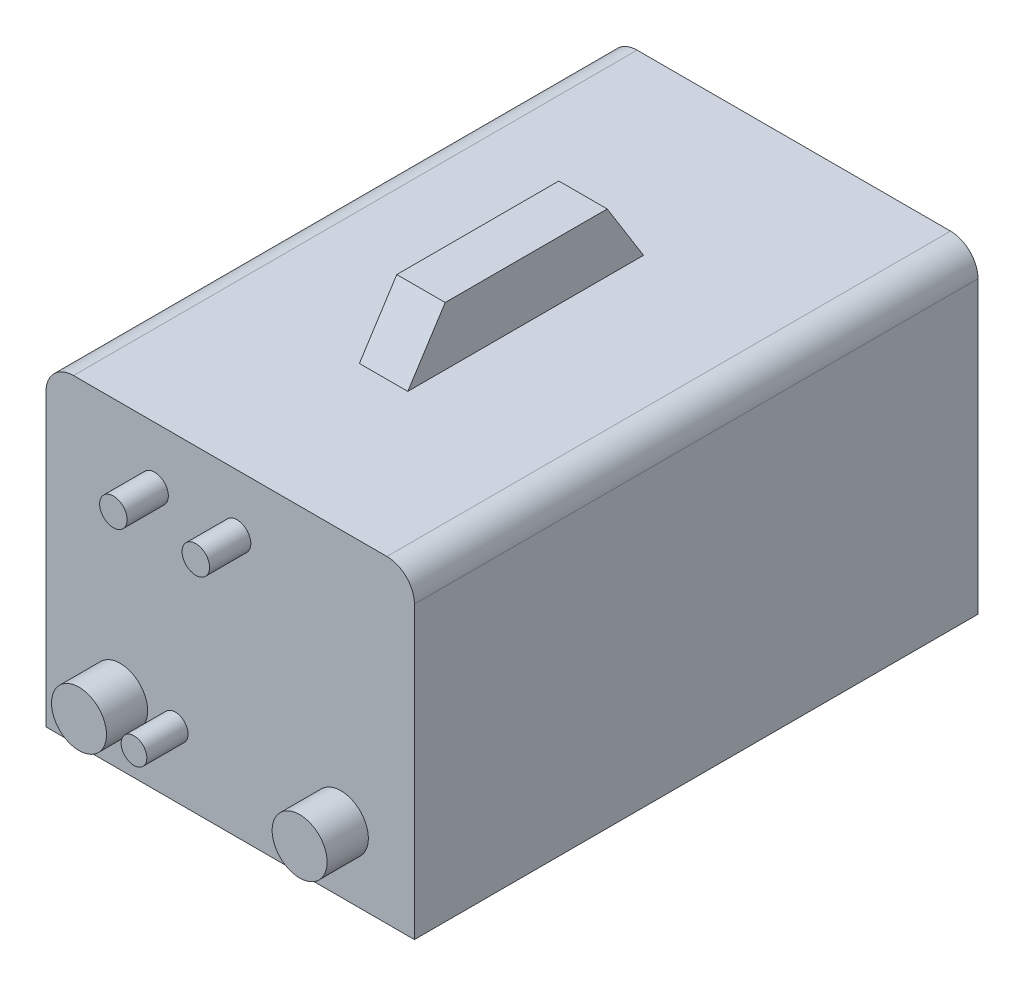
ISO-10303-21;
HEADER;
FILE_DESCRIPTION(('STEP AP214'),'2;1');
FILE_NAME('part.step','',(''),(''),'','','');
FILE_SCHEMA(('AUTOMOTIVE_DESIGN { 1 0 10303 214 1 1 1 1 }'));
ENDSEC;
DATA;
#1=APPLICATION_CONTEXT('core data for automotive mechanical design processes');
#2=APPLICATION_PROTOCOL_DEFINITION('international standard','automotive_design',2000,#1);
#3=PRODUCT_CONTEXT('',#1,'mechanical');
#4=PRODUCT('Part','Part','',(#3));
#5=PRODUCT_RELATED_PRODUCT_CATEGORY('part','',(#4));
#6=PRODUCT_DEFINITION_FORMATION('','',#4);
#7=PRODUCT_DEFINITION_CONTEXT('part definition',#1,'design');
#8=PRODUCT_DEFINITION('design','',#6,#7);
#9=PRODUCT_DEFINITION_SHAPE('','',#8);
#10=(LENGTH_UNIT() NAMED_UNIT(*) SI_UNIT(.MILLI.,.METRE.));
#11=(NAMED_UNIT(*) PLANE_ANGLE_UNIT() SI_UNIT($,.RADIAN.));
#12=(NAMED_UNIT(*) SI_UNIT($,.STERADIAN.) SOLID_ANGLE_UNIT());
#13=UNCERTAINTY_MEASURE_WITH_UNIT(LENGTH_MEASURE(1.E-05),#10,'distance_accuracy_value','');
#14=(GEOMETRIC_REPRESENTATION_CONTEXT(3) GLOBAL_UNCERTAINTY_ASSIGNED_CONTEXT((#13)) GLOBAL_UNIT_ASSIGNED_CONTEXT((#10,
#11,#12)) REPRESENTATION_CONTEXT('',''));
#15=CARTESIAN_POINT('',(0.,0.,0.));
#16=DIRECTION('',(0.,0.,1.));
#17=DIRECTION('',(1.,0.,0.));
#18=AXIS2_PLACEMENT_3D('',#15,#16,#17);
#19=CARTESIAN_POINT('',(134.,2.22044604925031E-13,410.));
#20=DIRECTION('',(-1.,0.,0.));
#21=DIRECTION('',(0.,0.,1.));
#22=AXIS2_PLACEMENT_3D('',#19,#20,#21);
#23=PLANE('',#22);
#24=DIRECTION('',(0.,1.,0.));
#25=VECTOR('',#24,1.);
#26=CARTESIAN_POINT('',(134.,2.22044604925031E-13,0.));
#27=LINE('',#26,#25);
#28=CARTESIAN_POINT('',(134.,2.22044604925031E-13,0.));
#29=VERTEX_POINT('',#28);
#30=CARTESIAN_POINT('',(134.,211.383370154784,0.));
#31=VERTEX_POINT('',#30);
#32=EDGE_CURVE('E122',#29,#31,#27,.T.);
#33=ORIENTED_EDGE('',*,*,#32,.T.);
#34=DIRECTION('',(0.,0.,-1.));
#35=VECTOR('',#34,1.);
#36=CARTESIAN_POINT('',(134.,211.383370154784,410.));
#37=LINE('',#36,#35);
#38=CARTESIAN_POINT('',(134.,211.383370154784,410.));
#39=VERTEX_POINT('',#38);
#40=EDGE_CURVE('E153',#39,#31,#37,.T.);
#41=ORIENTED_EDGE('',*,*,#40,.F.);
#42=DIRECTION('',(0.,1.,0.));
#43=VECTOR('',#42,1.);
#44=CARTESIAN_POINT('',(134.,2.22044604925031E-13,410.));
#45=LINE('',#44,#43);
#46=CARTESIAN_POINT('',(134.,2.22044604925031E-13,410.));
#47=VERTEX_POINT('',#46);
#48=EDGE_CURVE('E135',#47,#39,#45,.T.);
#49=ORIENTED_EDGE('',*,*,#48,.F.);
#50=DIRECTION('',(0.,0.,-1.));
#51=VECTOR('',#50,1.);
#52=CARTESIAN_POINT('',(134.,2.22044604925031E-13,410.));
#53=LINE('',#52,#51);
#54=EDGE_CURVE('E118',#47,#29,#53,.T.);
#55=ORIENTED_EDGE('',*,*,#54,.T.);
#56=EDGE_LOOP('',(#33,#41,#49,#55));
#57=FACE_BOUND('',#56,.T.);
#58=ADVANCED_FACE('F35',(#57),#23,.F.);
#59=CARTESIAN_POINT('',(114.,211.383370154784,410.));
#60=DIRECTION('',(0.,0.,-1.));
#61=DIRECTION('',(-1.,0.,0.));
#62=AXIS2_PLACEMENT_3D('',#59,#60,#61);
#63=CYLINDRICAL_SURFACE('',#62,20.);
#64=CARTESIAN_POINT('',(114.,211.383370154784,0.));
#65=DIRECTION('',(0.,0.,1.));
#66=DIRECTION('',(1.,0.,0.));
#67=AXIS2_PLACEMENT_3D('',#64,#65,#66);
#68=CIRCLE('',#67,20.);
#69=CARTESIAN_POINT('',(114.,231.383370154784,0.));
#70=VERTEX_POINT('',#69);
#71=EDGE_CURVE('E125',#31,#70,#68,.T.);
#72=ORIENTED_EDGE('',*,*,#71,.T.);
#73=DIRECTION('',(0.,0.,-1.));
#74=VECTOR('',#73,1.);
#75=CARTESIAN_POINT('',(114.,231.383370154784,410.));
#76=LINE('',#75,#74);
#77=CARTESIAN_POINT('',(114.,231.383370154784,410.));
#78=VERTEX_POINT('',#77);
#79=EDGE_CURVE('E151',#78,#70,#76,.T.);
#80=ORIENTED_EDGE('',*,*,#79,.F.);
#81=CARTESIAN_POINT('',(114.,211.383370154784,410.));
#82=DIRECTION('',(0.,0.,1.));
#83=DIRECTION('',(1.,0.,0.));
#84=AXIS2_PLACEMENT_3D('',#81,#82,#83);
#85=CIRCLE('',#84,20.);
#86=EDGE_CURVE('E90',#39,#78,#85,.T.);
#87=ORIENTED_EDGE('',*,*,#86,.F.);
#88=ORIENTED_EDGE('',*,*,#40,.T.);
#89=EDGE_LOOP('',(#72,#80,#87,#88));
#90=FACE_BOUND('',#89,.T.);
#91=ADVANCED_FACE('F168',(#90),#63,.T.);
#92=CARTESIAN_POINT('',(17.6138124314676,231.383370154784,410.));
#93=DIRECTION('',(-1.,0.,0.));
#94=DIRECTION('',(0.,0.,1.));
#95=AXIS2_PLACEMENT_3D('',#92,#93,#94);
#96=PLANE('',#95);
#97=DIRECTION('',(0.,0.,-1.));
#98=VECTOR('',#97,1.);
#99=CARTESIAN_POINT('',(17.6138124314676,273.795473598618,410.));
#100=LINE('',#99,#98);
#101=CARTESIAN_POINT('',(17.6138124314676,273.795473598618,271.206372328283));
#102=VERTEX_POINT('',#101);
#103=CARTESIAN_POINT('',(17.6138124314676,273.795473598618,153.338385259462));
#104=VERTEX_POINT('',#103);
#105=EDGE_CURVE('E145',#102,#104,#100,.T.);
#106=ORIENTED_EDGE('',*,*,#105,.F.);
#107=DIRECTION('',(0.,-0.841720193981353,0.539913988561135));
#108=VECTOR('',#107,1.);
#109=CARTESIAN_POINT('',(17.6138124314676,180.67113282143,330.940158710806));
#110=LINE('',#109,#108);
#111=CARTESIAN_POINT('',(17.6138124314676,231.383370154784,298.411241710489));
#112=VERTEX_POINT('',#111);
#113=EDGE_CURVE('E126',#102,#112,#110,.T.);
#114=ORIENTED_EDGE('',*,*,#113,.T.);
#115=DIRECTION('',(0.,0.,-1.));
#116=VECTOR('',#115,1.);
#117=CARTESIAN_POINT('',(17.6138124314676,231.383370154784,410.));
#118=LINE('',#117,#116);
#119=CARTESIAN_POINT('',(17.6138124314676,231.383370154784,126.945001879861));
#120=VERTEX_POINT('',#119);
#121=EDGE_CURVE('E148',#112,#120,#118,.T.);
#122=ORIENTED_EDGE('',*,*,#121,.T.);
#123=DIRECTION('',(0.,0.849024005683572,0.528354272976969));
#124=VECTOR('',#123,1.);
#125=CARTESIAN_POINT('',(17.6138124314676,358.357727049287,205.962136347925));
#126=LINE('',#125,#124);
#127=EDGE_CURVE('E483',#120,#104,#126,.T.);
#128=ORIENTED_EDGE('',*,*,#127,.T.);
#129=EDGE_LOOP('',(#106,#114,#122,#128));
#130=FACE_BOUND('',#129,.T.);
#131=ADVANCED_FACE('F186',(#130),#96,.F.);
#132=CARTESIAN_POINT('',(17.6138124314676,273.795473598618,410.));
#133=DIRECTION('',(0.,-1.,0.));
#134=DIRECTION('',(0.,0.,-1.));
#135=AXIS2_PLACEMENT_3D('',#132,#133,#134);
#136=PLANE('',#135);
#137=DIRECTION('',(0.,0.,-1.));
#138=VECTOR('',#137,1.);
#139=CARTESIAN_POINT('',(-17.6138124314676,273.795473598618,410.));
#140=LINE('',#139,#138);
#141=CARTESIAN_POINT('',(-17.6138124314677,273.795473598618,271.206372328283));
#142=VERTEX_POINT('',#141);
#143=CARTESIAN_POINT('',(-17.6138124314677,273.795473598618,153.338385259462));
#144=VERTEX_POINT('',#143);
#145=EDGE_CURVE('E142',#142,#144,#140,.T.);
#146=ORIENTED_EDGE('',*,*,#145,.F.);
#147=DIRECTION('',(1.,0.,0.));
#148=VECTOR('',#147,1.);
#149=CARTESIAN_POINT('',(-165.,273.795473598618,271.206372328283));
#150=LINE('',#149,#148);
#151=EDGE_CURVE('E469',#142,#102,#150,.T.);
#152=ORIENTED_EDGE('',*,*,#151,.T.);
#153=ORIENTED_EDGE('',*,*,#105,.T.);
#154=DIRECTION('',(1.,0.,0.));
#155=VECTOR('',#154,1.);
#156=CARTESIAN_POINT('',(-165.,273.795473598618,153.338385259462));
#157=LINE('',#156,#155);
#158=EDGE_CURVE('E466',#144,#104,#157,.T.);
#159=ORIENTED_EDGE('',*,*,#158,.F.);
#160=EDGE_LOOP('',(#146,#152,#153,#159));
#161=FACE_BOUND('',#160,.T.);
#162=ADVANCED_FACE('F190',(#161),#136,.F.);
#163=CARTESIAN_POINT('',(-17.6138124314676,231.383370154784,410.));
#164=DIRECTION('',(1.,0.,0.));
#165=DIRECTION('',(0.,0.,-1.));
#166=AXIS2_PLACEMENT_3D('',#163,#164,#165);
#167=PLANE('',#166);
#168=DIRECTION('',(0.,0.,-1.));
#169=VECTOR('',#168,1.);
#170=CARTESIAN_POINT('',(-17.6138124314676,231.383370154784,410.));
#171=LINE('',#170,#169);
#172=CARTESIAN_POINT('',(-17.6138124314677,231.383370154784,298.411241710489));
#173=VERTEX_POINT('',#172);
#174=CARTESIAN_POINT('',(-17.6138124314677,231.383370154784,126.945001879861));
#175=VERTEX_POINT('',#174);
#176=EDGE_CURVE('E139',#173,#175,#171,.T.);
#177=ORIENTED_EDGE('',*,*,#176,.F.);
#178=DIRECTION('',(0.,0.841720193981353,-0.539913988561135));
#179=VECTOR('',#178,1.);
#180=CARTESIAN_POINT('',(-17.6138124314676,180.67113282143,330.940158710806));
#181=LINE('',#180,#179);
#182=EDGE_CURVE('E486',#173,#142,#181,.T.);
#183=ORIENTED_EDGE('',*,*,#182,.T.);
#184=ORIENTED_EDGE('',*,*,#145,.T.);
#185=DIRECTION('',(0.,-0.849024005683572,-0.528354272976969));
#186=VECTOR('',#185,1.);
#187=CARTESIAN_POINT('',(-17.6138124314676,358.357727049287,205.962136347925));
#188=LINE('',#187,#186);
#189=EDGE_CURVE('E472',#144,#175,#188,.T.);
#190=ORIENTED_EDGE('',*,*,#189,.T.);
#191=EDGE_LOOP('',(#177,#183,#184,#190));
#192=FACE_BOUND('',#191,.T.);
#193=ADVANCED_FACE('F196',(#192),#167,.F.);
#194=CARTESIAN_POINT('',(-114.,231.383370154784,410.));
#195=DIRECTION('',(0.,-1.,0.));
#196=DIRECTION('',(0.,0.,-1.));
#197=AXIS2_PLACEMENT_3D('',#194,#195,#196);
#198=PLANE('',#197);
#199=ORIENTED_EDGE('',*,*,#79,.T.);
#200=DIRECTION('',(-1.,0.,0.));
#201=VECTOR('',#200,1.);
#202=CARTESIAN_POINT('',(-114.,231.383370154784,0.));
#203=LINE('',#202,#201);
#204=CARTESIAN_POINT('',(-114.,231.383370154784,0.));
#205=VERTEX_POINT('',#204);
#206=EDGE_CURVE('E129',#70,#205,#203,.T.);
#207=ORIENTED_EDGE('',*,*,#206,.T.);
#208=DIRECTION('',(0.,0.,-1.));
#209=VECTOR('',#208,1.);
#210=CARTESIAN_POINT('',(-114.,231.383370154784,410.));
#211=LINE('',#210,#209);
#212=CARTESIAN_POINT('',(-114.,231.383370154784,410.));
#213=VERTEX_POINT('',#212);
#214=EDGE_CURVE('E113',#213,#205,#211,.T.);
#215=ORIENTED_EDGE('',*,*,#214,.F.);
#216=DIRECTION('',(-1.,0.,0.));
#217=VECTOR('',#216,1.);
#218=CARTESIAN_POINT('',(114.,231.383370154784,410.));
#219=LINE('',#218,#217);
#220=EDGE_CURVE('E105',#78,#213,#219,.T.);
#221=ORIENTED_EDGE('',*,*,#220,.F.);
#222=EDGE_LOOP('',(#199,#207,#215,#221));
#223=FACE_BOUND('',#222,.T.);
#224=ORIENTED_EDGE('',*,*,#121,.F.);
#225=DIRECTION('',(1.,0.,0.));
#226=VECTOR('',#225,1.);
#227=CARTESIAN_POINT('',(-165.,231.383370154784,298.411241710489));
#228=LINE('',#227,#226);
#229=EDGE_CURVE('E473',#173,#112,#228,.T.);
#230=ORIENTED_EDGE('',*,*,#229,.F.);
#231=ORIENTED_EDGE('',*,*,#176,.T.);
#232=DIRECTION('',(1.,0.,0.));
#233=VECTOR('',#232,1.);
#234=CARTESIAN_POINT('',(-165.,231.383370154784,126.945001879861));
#235=LINE('',#234,#233);
#236=EDGE_CURVE('E476',#175,#120,#235,.T.);
#237=ORIENTED_EDGE('',*,*,#236,.T.);
#238=EDGE_LOOP('',(#224,#230,#231,#237));
#239=FACE_BOUND('',#238,.T.);
#240=ADVANCED_FACE('F200',(#223,#239),#198,.F.);
#241=CARTESIAN_POINT('',(-114.,211.383370154784,410.));
#242=DIRECTION('',(0.,0.,-1.));
#243=DIRECTION('',(-1.,0.,0.));
#244=AXIS2_PLACEMENT_3D('',#241,#242,#243);
#245=CYLINDRICAL_SURFACE('',#244,20.);
#246=CARTESIAN_POINT('',(-114.,211.383370154784,0.));
#247=DIRECTION('',(0.,0.,1.));
#248=DIRECTION('',(1.,0.,0.));
#249=AXIS2_PLACEMENT_3D('',#246,#247,#248);
#250=CIRCLE('',#249,20.);
#251=CARTESIAN_POINT('',(-134.,211.383370154784,0.));
#252=VERTEX_POINT('',#251);
#253=EDGE_CURVE('E112',#205,#252,#250,.T.);
#254=ORIENTED_EDGE('',*,*,#253,.T.);
#255=DIRECTION('',(0.,0.,-1.));
#256=VECTOR('',#255,1.);
#257=CARTESIAN_POINT('',(-134.,211.383370154784,410.));
#258=LINE('',#257,#256);
#259=CARTESIAN_POINT('',(-134.,211.383370154784,410.));
#260=VERTEX_POINT('',#259);
#261=EDGE_CURVE('E109',#260,#252,#258,.T.);
#262=ORIENTED_EDGE('',*,*,#261,.F.);
#263=CARTESIAN_POINT('',(-114.,211.383370154784,410.));
#264=DIRECTION('',(0.,0.,1.));
#265=DIRECTION('',(1.,0.,0.));
#266=AXIS2_PLACEMENT_3D('',#263,#264,#265);
#267=CIRCLE('',#266,20.);
#268=EDGE_CURVE('E99',#213,#260,#267,.T.);
#269=ORIENTED_EDGE('',*,*,#268,.F.);
#270=ORIENTED_EDGE('',*,*,#214,.T.);
#271=EDGE_LOOP('',(#254,#262,#269,#270));
#272=FACE_BOUND('',#271,.T.);
#273=ADVANCED_FACE('F110',(#272),#245,.T.);
#274=CARTESIAN_POINT('',(-134.,2.22044604925031E-13,410.));
#275=DIRECTION('',(1.,0.,0.));
#276=DIRECTION('',(0.,0.,-1.));
#277=AXIS2_PLACEMENT_3D('',#274,#275,#276);
#278=PLANE('',#277);
#279=DIRECTION('',(0.,-1.,0.));
#280=VECTOR('',#279,1.);
#281=CARTESIAN_POINT('',(-134.,2.22044604925031E-13,0.));
#282=LINE('',#281,#280);
#283=CARTESIAN_POINT('',(-134.,2.22044604925031E-13,0.));
#284=VERTEX_POINT('',#283);
#285=EDGE_CURVE('E75',#252,#284,#282,.T.);
#286=ORIENTED_EDGE('',*,*,#285,.T.);
#287=DIRECTION('',(0.,0.,-1.));
#288=VECTOR('',#287,1.);
#289=CARTESIAN_POINT('',(-134.,2.22044604925031E-13,410.));
#290=LINE('',#289,#288);
#291=CARTESIAN_POINT('',(-134.,2.22044604925031E-13,410.));
#292=VERTEX_POINT('',#291);
#293=EDGE_CURVE('E114',#292,#284,#290,.T.);
#294=ORIENTED_EDGE('',*,*,#293,.F.);
#295=DIRECTION('',(0.,-1.,0.));
#296=VECTOR('',#295,1.);
#297=CARTESIAN_POINT('',(-134.,2.22044604925031E-13,410.));
#298=LINE('',#297,#296);
#299=EDGE_CURVE('E103',#260,#292,#298,.T.);
#300=ORIENTED_EDGE('',*,*,#299,.F.);
#301=ORIENTED_EDGE('',*,*,#261,.T.);
#302=EDGE_LOOP('',(#286,#294,#300,#301));
#303=FACE_BOUND('',#302,.T.);
#304=ADVANCED_FACE('F116',(#303),#278,.F.);
#305=CARTESIAN_POINT('',(-134.,2.22044604925031E-13,410.));
#306=DIRECTION('',(0.,1.,0.));
#307=DIRECTION('',(0.,0.,1.));
#308=AXIS2_PLACEMENT_3D('',#305,#306,#307);
#309=PLANE('',#308);
#310=DIRECTION('',(1.,0.,0.));
#311=VECTOR('',#310,1.);
#312=CARTESIAN_POINT('',(-134.,2.22044604925031E-13,0.));
#313=LINE('',#312,#311);
#314=EDGE_CURVE('E81',#284,#29,#313,.T.);
#315=ORIENTED_EDGE('',*,*,#314,.T.);
#316=ORIENTED_EDGE('',*,*,#54,.F.);
#317=DIRECTION('',(1.,0.,0.));
#318=VECTOR('',#317,1.);
#319=CARTESIAN_POINT('',(-134.,2.22044604925031E-13,410.));
#320=LINE('',#319,#318);
#321=EDGE_CURVE('E51',#292,#47,#320,.T.);
#322=ORIENTED_EDGE('',*,*,#321,.F.);
#323=ORIENTED_EDGE('',*,*,#293,.T.);
#324=EDGE_LOOP('',(#315,#316,#322,#323));
#325=FACE_BOUND('',#324,.T.);
#326=ADVANCED_FACE('F172',(#325),#309,.F.);
#327=CARTESIAN_POINT('',(114.,211.383370154784,410.));
#328=DIRECTION('',(0.,0.,1.));
#329=DIRECTION('',(1.,0.,0.));
#330=AXIS2_PLACEMENT_3D('',#327,#328,#329);
#331=PLANE('',#330);
#332=CARTESIAN_POINT('',(5.,190.,410.));
#333=DIRECTION('',(0.,0.,1.));
#334=DIRECTION('',(1.,0.,0.));
#335=AXIS2_PLACEMENT_3D('',#332,#333,#334);
#336=CIRCLE('',#335,10.);
#337=CARTESIAN_POINT('',(15.,190.,410.));
#338=VERTEX_POINT('',#337);
#339=EDGE_CURVE('E436',#338,#338,#336,.T.);
#340=ORIENTED_EDGE('',*,*,#339,.F.);
#341=EDGE_LOOP('',(#340));
#342=FACE_BOUND('',#341,.T.);
#343=CARTESIAN_POINT('',(-55.,190.,410.));
#344=DIRECTION('',(0.,0.,1.));
#345=DIRECTION('',(1.,0.,0.));
#346=AXIS2_PLACEMENT_3D('',#343,#344,#345);
#347=CIRCLE('',#346,10.);
#348=CARTESIAN_POINT('',(-45.,190.,410.));
#349=VERTEX_POINT('',#348);
#350=EDGE_CURVE('E442',#349,#349,#347,.T.);
#351=ORIENTED_EDGE('',*,*,#350,.F.);
#352=EDGE_LOOP('',(#351));
#353=FACE_BOUND('',#352,.T.);
#354=CARTESIAN_POINT('',(80.5093294969813,47.0693136460908,410.));
#355=DIRECTION('',(0.,0.,1.));
#356=DIRECTION('',(1.,0.,0.));
#357=AXIS2_PLACEMENT_3D('',#354,#355,#356);
#358=CIRCLE('',#357,19.9999999999999);
#359=CARTESIAN_POINT('',(100.509329496981,47.0693136460908,410.));
#360=VERTEX_POINT('',#359);
#361=EDGE_CURVE('E448',#360,#360,#358,.T.);
#362=ORIENTED_EDGE('',*,*,#361,.F.);
#363=EDGE_LOOP('',(#362));
#364=FACE_BOUND('',#363,.T.);
#365=CARTESIAN_POINT('',(-40.,47.0693136460908,410.));
#366=DIRECTION('',(0.,0.,1.));
#367=DIRECTION('',(1.,0.,0.));
#368=AXIS2_PLACEMENT_3D('',#365,#366,#367);
#369=CIRCLE('',#368,9.34104242685201);
#370=CARTESIAN_POINT('',(-30.658957573148,47.0693136460908,410.));
#371=VERTEX_POINT('',#370);
#372=EDGE_CURVE('E454',#371,#371,#369,.T.);
#373=ORIENTED_EDGE('',*,*,#372,.F.);
#374=EDGE_LOOP('',(#373));
#375=FACE_BOUND('',#374,.T.);
#376=CARTESIAN_POINT('',(-80.,47.0693136460908,410.));
#377=DIRECTION('',(0.,0.,1.));
#378=DIRECTION('',(1.,0.,0.));
#379=AXIS2_PLACEMENT_3D('',#376,#377,#378);
#380=CIRCLE('',#379,20.);
#381=CARTESIAN_POINT('',(-60.,47.0693136460908,410.));
#382=VERTEX_POINT('',#381);
#383=EDGE_CURVE('E460',#382,#382,#380,.T.);
#384=ORIENTED_EDGE('',*,*,#383,.F.);
#385=EDGE_LOOP('',(#384));
#386=FACE_BOUND('',#385,.T.);
#387=ORIENTED_EDGE('',*,*,#220,.T.);
#388=ORIENTED_EDGE('',*,*,#268,.T.);
#389=ORIENTED_EDGE('',*,*,#299,.T.);
#390=ORIENTED_EDGE('',*,*,#321,.T.);
#391=ORIENTED_EDGE('',*,*,#48,.T.);
#392=ORIENTED_EDGE('',*,*,#86,.T.);
#393=EDGE_LOOP('',(#387,#388,#389,#390,#391,#392));
#394=FACE_BOUND('',#393,.T.);
#395=ADVANCED_FACE('F101',(#342,#353,#364,#375,#386,#394),#331,.T.);
#396=CARTESIAN_POINT('',(114.,211.383370154784,0.));
#397=DIRECTION('',(0.,0.,1.));
#398=DIRECTION('',(1.,0.,0.));
#399=AXIS2_PLACEMENT_3D('',#396,#397,#398);
#400=PLANE('',#399);
#401=CARTESIAN_POINT('',(73.8134337645285,29.9340522364681,0.));
#402=DIRECTION('',(0.,0.,1.));
#403=DIRECTION('',(1.,0.,0.));
#404=AXIS2_PLACEMENT_3D('',#401,#402,#403);
#405=CIRCLE('',#404,9.22667922056602);
#406=CARTESIAN_POINT('',(83.0401129850945,29.9340522364681,0.));
#407=VERTEX_POINT('',#406);
#408=EDGE_CURVE('E11',#407,#407,#405,.F.);
#409=ORIENTED_EDGE('',*,*,#408,.F.);
#410=EDGE_LOOP('',(#409));
#411=FACE_BOUND('',#410,.T.);
#412=CARTESIAN_POINT('',(12.3022389607548,29.9340522364681,0.));
#413=DIRECTION('',(0.,0.,1.));
#414=DIRECTION('',(1.,0.,0.));
#415=AXIS2_PLACEMENT_3D('',#412,#413,#414);
#416=CIRCLE('',#415,8.25493161637547);
#417=CARTESIAN_POINT('',(20.5571705771302,29.9340522364681,0.));
#418=VERTEX_POINT('',#417);
#419=EDGE_CURVE('E43',#418,#418,#416,.F.);
#420=ORIENTED_EDGE('',*,*,#419,.F.);
#421=EDGE_LOOP('',(#420));
#422=FACE_BOUND('',#421,.T.);
#423=ORIENTED_EDGE('',*,*,#206,.F.);
#424=ORIENTED_EDGE('',*,*,#71,.F.);
#425=ORIENTED_EDGE('',*,*,#32,.F.);
#426=ORIENTED_EDGE('',*,*,#314,.F.);
#427=ORIENTED_EDGE('',*,*,#285,.F.);
#428=ORIENTED_EDGE('',*,*,#253,.F.);
#429=EDGE_LOOP('',(#423,#424,#425,#426,#427,#428));
#430=FACE_BOUND('',#429,.T.);
#431=ADVANCED_FACE('F159',(#411,#422,#430),#400,.F.);
#432=CARTESIAN_POINT('',(-165.,273.795473598618,153.338385259462));
#433=DIRECTION('',(0.,-0.528354272976969,0.849024005683572));
#434=DIRECTION('',(0.,-0.849024005683572,-0.528354272976969));
#435=AXIS2_PLACEMENT_3D('',#432,#433,#434);
#436=PLANE('',#435);
#437=ORIENTED_EDGE('',*,*,#236,.F.);
#438=ORIENTED_EDGE('',*,*,#189,.F.);
#439=ORIENTED_EDGE('',*,*,#158,.T.);
#440=ORIENTED_EDGE('',*,*,#127,.F.);
#441=EDGE_LOOP('',(#437,#438,#439,#440));
#442=FACE_BOUND('',#441,.T.);
#443=ADVANCED_FACE('F162',(#442),#436,.F.);
#444=CARTESIAN_POINT('',(-165.,273.795473598618,271.206372328283));
#445=DIRECTION('',(0.,-0.539913988561134,-0.841720193981353));
#446=DIRECTION('',(0.,0.841720193981353,-0.539913988561135));
#447=AXIS2_PLACEMENT_3D('',#444,#445,#446);
#448=PLANE('',#447);
#449=ORIENTED_EDGE('',*,*,#151,.F.);
#450=ORIENTED_EDGE('',*,*,#182,.F.);
#451=ORIENTED_EDGE('',*,*,#229,.T.);
#452=ORIENTED_EDGE('',*,*,#113,.F.);
#453=EDGE_LOOP('',(#449,#450,#451,#452));
#454=FACE_BOUND('',#453,.T.);
#455=ADVANCED_FACE('F261',(#454),#448,.F.);
#456=CARTESIAN_POINT('',(-80.,47.0693136460908,440.));
#457=DIRECTION('',(0.,0.,-1.));
#458=DIRECTION('',(-1.,0.,0.));
#459=AXIS2_PLACEMENT_3D('',#456,#457,#458);
#460=CYLINDRICAL_SURFACE('',#459,20.);
#461=CARTESIAN_POINT('',(-80.,47.0693136460908,440.));
#462=DIRECTION('',(0.,0.,1.));
#463=DIRECTION('',(1.,0.,0.));
#464=AXIS2_PLACEMENT_3D('',#461,#462,#463);
#465=CIRCLE('',#464,20.);
#466=CARTESIAN_POINT('',(-60.,47.0693136460908,440.));
#467=VERTEX_POINT('',#466);
#468=EDGE_CURVE('E463',#467,#467,#465,.T.);
#469=ORIENTED_EDGE('',*,*,#468,.F.);
#470=EDGE_LOOP('',(#469));
#471=FACE_BOUND('',#470,.T.);
#472=ORIENTED_EDGE('',*,*,#383,.T.);
#473=EDGE_LOOP('',(#472));
#474=FACE_BOUND('',#473,.T.);
#475=ADVANCED_FACE('F270',(#471,#474),#460,.T.);
#476=CARTESIAN_POINT('',(-80.,47.0693136460908,440.));
#477=DIRECTION('',(0.,0.,1.));
#478=DIRECTION('',(1.,0.,0.));
#479=AXIS2_PLACEMENT_3D('',#476,#477,#478);
#480=PLANE('',#479);
#481=ORIENTED_EDGE('',*,*,#468,.T.);
#482=EDGE_LOOP('',(#481));
#483=FACE_BOUND('',#482,.T.);
#484=ADVANCED_FACE('F280',(#483),#480,.T.);
#485=CARTESIAN_POINT('',(-40.,47.0693136460908,440.));
#486=DIRECTION('',(0.,0.,-1.));
#487=DIRECTION('',(-1.,0.,0.));
#488=AXIS2_PLACEMENT_3D('',#485,#486,#487);
#489=CYLINDRICAL_SURFACE('',#488,9.34104242685201);
#490=CARTESIAN_POINT('',(-40.,47.0693136460908,440.));
#491=DIRECTION('',(0.,0.,1.));
#492=DIRECTION('',(1.,0.,0.));
#493=AXIS2_PLACEMENT_3D('',#490,#491,#492);
#494=CIRCLE('',#493,9.34104242685201);
#495=CARTESIAN_POINT('',(-30.658957573148,47.0693136460908,440.));
#496=VERTEX_POINT('',#495);
#497=EDGE_CURVE('E457',#496,#496,#494,.T.);
#498=ORIENTED_EDGE('',*,*,#497,.F.);
#499=EDGE_LOOP('',(#498));
#500=FACE_BOUND('',#499,.T.);
#501=ORIENTED_EDGE('',*,*,#372,.T.);
#502=EDGE_LOOP('',(#501));
#503=FACE_BOUND('',#502,.T.);
#504=ADVANCED_FACE('F289',(#500,#503),#489,.T.);
#505=CARTESIAN_POINT('',(-40.,47.0693136460908,440.));
#506=DIRECTION('',(0.,0.,1.));
#507=DIRECTION('',(1.,0.,0.));
#508=AXIS2_PLACEMENT_3D('',#505,#506,#507);
#509=PLANE('',#508);
#510=ORIENTED_EDGE('',*,*,#497,.T.);
#511=EDGE_LOOP('',(#510));
#512=FACE_BOUND('',#511,.T.);
#513=ADVANCED_FACE('F298',(#512),#509,.T.);
#514=CARTESIAN_POINT('',(80.5093294969813,47.0693136460908,440.));
#515=DIRECTION('',(0.,0.,-1.));
#516=DIRECTION('',(-1.,0.,0.));
#517=AXIS2_PLACEMENT_3D('',#514,#515,#516);
#518=CYLINDRICAL_SURFACE('',#517,19.9999999999999);
#519=CARTESIAN_POINT('',(80.5093294969813,47.0693136460908,440.));
#520=DIRECTION('',(0.,0.,1.));
#521=DIRECTION('',(1.,0.,0.));
#522=AXIS2_PLACEMENT_3D('',#519,#520,#521);
#523=CIRCLE('',#522,19.9999999999999);
#524=CARTESIAN_POINT('',(100.509329496981,47.0693136460908,440.));
#525=VERTEX_POINT('',#524);
#526=EDGE_CURVE('E451',#525,#525,#523,.T.);
#527=ORIENTED_EDGE('',*,*,#526,.F.);
#528=EDGE_LOOP('',(#527));
#529=FACE_BOUND('',#528,.T.);
#530=ORIENTED_EDGE('',*,*,#361,.T.);
#531=EDGE_LOOP('',(#530));
#532=FACE_BOUND('',#531,.T.);
#533=ADVANCED_FACE('F307',(#529,#532),#518,.T.);
#534=CARTESIAN_POINT('',(80.5093294969813,47.0693136460908,440.));
#535=DIRECTION('',(0.,0.,1.));
#536=DIRECTION('',(1.,0.,0.));
#537=AXIS2_PLACEMENT_3D('',#534,#535,#536);
#538=PLANE('',#537);
#539=ORIENTED_EDGE('',*,*,#526,.T.);
#540=EDGE_LOOP('',(#539));
#541=FACE_BOUND('',#540,.T.);
#542=ADVANCED_FACE('F316',(#541),#538,.T.);
#543=CARTESIAN_POINT('',(-55.,190.,440.));
#544=DIRECTION('',(0.,0.,-1.));
#545=DIRECTION('',(-1.,0.,0.));
#546=AXIS2_PLACEMENT_3D('',#543,#544,#545);
#547=CYLINDRICAL_SURFACE('',#546,10.);
#548=CARTESIAN_POINT('',(-55.,190.,440.));
#549=DIRECTION('',(0.,0.,1.));
#550=DIRECTION('',(1.,0.,0.));
#551=AXIS2_PLACEMENT_3D('',#548,#549,#550);
#552=CIRCLE('',#551,10.);
#553=CARTESIAN_POINT('',(-45.,190.,440.));
#554=VERTEX_POINT('',#553);
#555=EDGE_CURVE('E445',#554,#554,#552,.T.);
#556=ORIENTED_EDGE('',*,*,#555,.F.);
#557=EDGE_LOOP('',(#556));
#558=FACE_BOUND('',#557,.T.);
#559=ORIENTED_EDGE('',*,*,#350,.T.);
#560=EDGE_LOOP('',(#559));
#561=FACE_BOUND('',#560,.T.);
#562=ADVANCED_FACE('F325',(#558,#561),#547,.T.);
#563=CARTESIAN_POINT('',(-55.,190.,440.));
#564=DIRECTION('',(0.,0.,1.));
#565=DIRECTION('',(1.,0.,0.));
#566=AXIS2_PLACEMENT_3D('',#563,#564,#565);
#567=PLANE('',#566);
#568=ORIENTED_EDGE('',*,*,#555,.T.);
#569=EDGE_LOOP('',(#568));
#570=FACE_BOUND('',#569,.T.);
#571=ADVANCED_FACE('F334',(#570),#567,.T.);
#572=CARTESIAN_POINT('',(5.,190.,440.));
#573=DIRECTION('',(0.,0.,-1.));
#574=DIRECTION('',(-1.,0.,0.));
#575=AXIS2_PLACEMENT_3D('',#572,#573,#574);
#576=CYLINDRICAL_SURFACE('',#575,10.);
#577=CARTESIAN_POINT('',(5.,190.,440.));
#578=DIRECTION('',(0.,0.,1.));
#579=DIRECTION('',(1.,0.,0.));
#580=AXIS2_PLACEMENT_3D('',#577,#578,#579);
#581=CIRCLE('',#580,10.);
#582=CARTESIAN_POINT('',(15.,190.,440.));
#583=VERTEX_POINT('',#582);
#584=EDGE_CURVE('E439',#583,#583,#581,.T.);
#585=ORIENTED_EDGE('',*,*,#584,.F.);
#586=EDGE_LOOP('',(#585));
#587=FACE_BOUND('',#586,.T.);
#588=ORIENTED_EDGE('',*,*,#339,.T.);
#589=EDGE_LOOP('',(#588));
#590=FACE_BOUND('',#589,.T.);
#591=ADVANCED_FACE('F343',(#587,#590),#576,.T.);
#592=CARTESIAN_POINT('',(5.,190.,440.));
#593=DIRECTION('',(0.,0.,1.));
#594=DIRECTION('',(1.,0.,0.));
#595=AXIS2_PLACEMENT_3D('',#592,#593,#594);
#596=PLANE('',#595);
#597=ORIENTED_EDGE('',*,*,#584,.T.);
#598=EDGE_LOOP('',(#597));
#599=FACE_BOUND('',#598,.T.);
#600=ADVANCED_FACE('F352',(#599),#596,.T.);
#601=CARTESIAN_POINT('',(12.3022389607548,29.9340522364681,-30.));
#602=DIRECTION('',(0.,0.,1.));
#603=DIRECTION('',(1.,0.,0.));
#604=AXIS2_PLACEMENT_3D('',#601,#602,#603);
#605=CYLINDRICAL_SURFACE('',#604,8.25493161637547);
#606=CARTESIAN_POINT('',(12.3022389607548,29.9340522364681,-30.));
#607=DIRECTION('',(0.,0.,-1.));
#608=DIRECTION('',(-1.,0.,0.));
#609=AXIS2_PLACEMENT_3D('',#606,#607,#608);
#610=CIRCLE('',#609,8.25493161637547);
#611=CARTESIAN_POINT('',(4.04730734437931,29.9340522364681,-30.));
#612=VERTEX_POINT('',#611);
#613=EDGE_CURVE('E433',#612,#612,#610,.T.);
#614=ORIENTED_EDGE('',*,*,#613,.F.);
#615=EDGE_LOOP('',(#614));
#616=FACE_BOUND('',#615,.T.);
#617=ORIENTED_EDGE('',*,*,#419,.T.);
#618=EDGE_LOOP('',(#617));
#619=FACE_BOUND('',#618,.T.);
#620=ADVANCED_FACE('F157',(#616,#619),#605,.T.);
#621=CARTESIAN_POINT('',(12.3022389607548,29.9340522364681,-30.));
#622=DIRECTION('',(0.,0.,-1.));
#623=DIRECTION('',(-1.,0.,0.));
#624=AXIS2_PLACEMENT_3D('',#621,#622,#623);
#625=PLANE('',#624);
#626=ORIENTED_EDGE('',*,*,#613,.T.);
#627=EDGE_LOOP('',(#626));
#628=FACE_BOUND('',#627,.T.);
#629=ADVANCED_FACE('F370',(#628),#625,.T.);
#630=CARTESIAN_POINT('',(73.8134337645285,29.9340522364681,-30.));
#631=DIRECTION('',(0.,0.,1.));
#632=DIRECTION('',(1.,0.,0.));
#633=AXIS2_PLACEMENT_3D('',#630,#631,#632);
#634=CYLINDRICAL_SURFACE('',#633,9.22667922056602);
#635=CARTESIAN_POINT('',(73.8134337645285,29.9340522364681,-30.));
#636=DIRECTION('',(0.,0.,-1.));
#637=DIRECTION('',(-1.,0.,0.));
#638=AXIS2_PLACEMENT_3D('',#635,#636,#637);
#639=CIRCLE('',#638,9.22667922056602);
#640=CARTESIAN_POINT('',(64.5867545439625,29.9340522364681,-30.));
#641=VERTEX_POINT('',#640);
#642=EDGE_CURVE('E432',#641,#641,#639,.T.);
#643=ORIENTED_EDGE('',*,*,#642,.F.);
#644=EDGE_LOOP('',(#643));
#645=FACE_BOUND('',#644,.T.);
#646=ORIENTED_EDGE('',*,*,#408,.T.);
#647=EDGE_LOOP('',(#646));
#648=FACE_BOUND('',#647,.T.);
#649=ADVANCED_FACE('F379',(#645,#648),#634,.T.);
#650=CARTESIAN_POINT('',(73.8134337645285,29.9340522364681,-30.));
#651=DIRECTION('',(0.,0.,-1.));
#652=DIRECTION('',(-1.,0.,0.));
#653=AXIS2_PLACEMENT_3D('',#650,#651,#652);
#654=PLANE('',#653);
#655=ORIENTED_EDGE('',*,*,#642,.T.);
#656=EDGE_LOOP('',(#655));
#657=FACE_BOUND('',#656,.T.);
#658=ADVANCED_FACE('F388',(#657),#654,.T.);
#659=CLOSED_SHELL('',(#58,#91,#131,#162,#193,#240,#273,#304,#326,#395,#431,#443,#455,#475,#484,
#504,#513,#533,#542,#562,#571,#591,#600,#620,#629,#649,#658));
#660=MANIFOLD_SOLID_BREP('B2',#659);
#661=ADVANCED_BREP_SHAPE_REPRESENTATION('',(#18,#660),#14);
#662=SHAPE_DEFINITION_REPRESENTATION(#9,#661);
ENDSEC;
END-ISO-10303-21;
